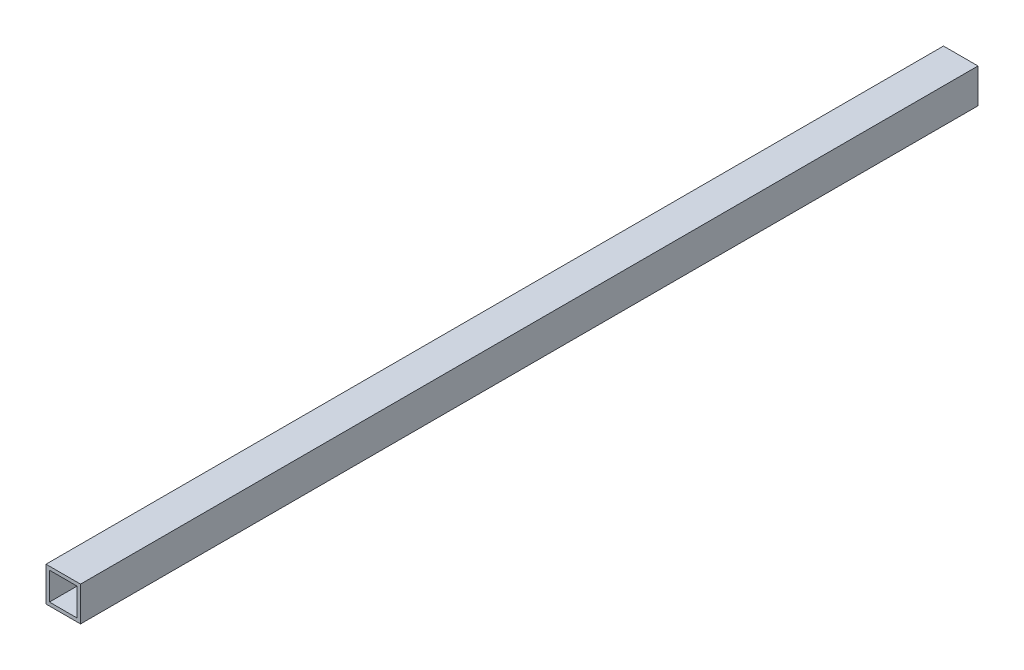
ISO-10303-21;
HEADER;
FILE_DESCRIPTION(('STEP AP214'),'2;1');
FILE_NAME('part.step','',(''),(''),'','','');
FILE_SCHEMA(('AUTOMOTIVE_DESIGN { 1 0 10303 214 1 1 1 1 }'));
ENDSEC;
DATA;
#1=APPLICATION_CONTEXT('core data for automotive mechanical design processes');
#2=APPLICATION_PROTOCOL_DEFINITION('international standard','automotive_design',2000,#1);
#3=PRODUCT_CONTEXT('',#1,'mechanical');
#4=PRODUCT('Part','Part','',(#3));
#5=PRODUCT_RELATED_PRODUCT_CATEGORY('part','',(#4));
#6=PRODUCT_DEFINITION_FORMATION('','',#4);
#7=PRODUCT_DEFINITION_CONTEXT('part definition',#1,'design');
#8=PRODUCT_DEFINITION('design','',#6,#7);
#9=PRODUCT_DEFINITION_SHAPE('','',#8);
#10=(LENGTH_UNIT() NAMED_UNIT(*) SI_UNIT(.MILLI.,.METRE.));
#11=(NAMED_UNIT(*) PLANE_ANGLE_UNIT() SI_UNIT($,.RADIAN.));
#12=(NAMED_UNIT(*) SI_UNIT($,.STERADIAN.) SOLID_ANGLE_UNIT());
#13=UNCERTAINTY_MEASURE_WITH_UNIT(LENGTH_MEASURE(1.E-05),#10,'distance_accuracy_value','');
#14=(GEOMETRIC_REPRESENTATION_CONTEXT(3) GLOBAL_UNCERTAINTY_ASSIGNED_CONTEXT((#13)) GLOBAL_UNIT_ASSIGNED_CONTEXT((#10,
#11,#12)) REPRESENTATION_CONTEXT('',''));
#15=CARTESIAN_POINT('',(0.,0.,0.));
#16=DIRECTION('',(0.,0.,1.));
#17=DIRECTION('',(1.,0.,0.));
#18=AXIS2_PLACEMENT_3D('',#15,#16,#17);
#19=CARTESIAN_POINT('',(9.99999999999999,10.,500.));
#20=DIRECTION('',(-1.,0.,0.));
#21=DIRECTION('',(0.,0.,1.));
#22=AXIS2_PLACEMENT_3D('',#19,#20,#21);
#23=PLANE('',#22);
#24=DIRECTION('',(0.,1.,0.));
#25=VECTOR('',#24,1.);
#26=CARTESIAN_POINT('',(9.99999999999999,10.,0.));
#27=LINE('',#26,#25);
#28=CARTESIAN_POINT('',(9.99999999999999,-10.,0.));
#29=VERTEX_POINT('',#28);
#30=CARTESIAN_POINT('',(9.99999999999999,10.,0.));
#31=VERTEX_POINT('',#30);
#32=EDGE_CURVE('E144',#29,#31,#27,.T.);
#33=ORIENTED_EDGE('',*,*,#32,.T.);
#34=DIRECTION('',(0.,0.,-1.));
#35=VECTOR('',#34,1.);
#36=CARTESIAN_POINT('',(9.99999999999999,10.,500.));
#37=LINE('',#36,#35);
#38=CARTESIAN_POINT('',(9.99999999999999,10.,520.));
#39=VERTEX_POINT('',#38);
#40=EDGE_CURVE('E161',#39,#31,#37,.T.);
#41=ORIENTED_EDGE('',*,*,#40,.F.);
#42=DIRECTION('',(0.,1.,0.));
#43=VECTOR('',#42,1.);
#44=CARTESIAN_POINT('',(9.99999999999999,10.,520.));
#45=LINE('',#44,#43);
#46=CARTESIAN_POINT('',(9.99999999999999,-10.,520.));
#47=VERTEX_POINT('',#46);
#48=EDGE_CURVE('E130',#47,#39,#45,.T.);
#49=ORIENTED_EDGE('',*,*,#48,.F.);
#50=DIRECTION('',(0.,0.,-1.));
#51=VECTOR('',#50,1.);
#52=CARTESIAN_POINT('',(9.99999999999999,-10.,500.));
#53=LINE('',#52,#51);
#54=EDGE_CURVE('E154',#47,#29,#53,.T.);
#55=ORIENTED_EDGE('',*,*,#54,.T.);
#56=EDGE_LOOP('',(#33,#41,#49,#55));
#57=FACE_BOUND('',#56,.T.);
#58=ADVANCED_FACE('F35',(#57),#23,.F.);
#59=CARTESIAN_POINT('',(-10.,10.,500.));
#60=DIRECTION('',(0.,-1.,0.));
#61=DIRECTION('',(0.,0.,-1.));
#62=AXIS2_PLACEMENT_3D('',#59,#60,#61);
#63=PLANE('',#62);
#64=DIRECTION('',(-1.,0.,0.));
#65=VECTOR('',#64,1.);
#66=CARTESIAN_POINT('',(-10.,10.,0.));
#67=LINE('',#66,#65);
#68=CARTESIAN_POINT('',(-10.,10.,0.));
#69=VERTEX_POINT('',#68);
#70=EDGE_CURVE('E149',#31,#69,#67,.T.);
#71=ORIENTED_EDGE('',*,*,#70,.T.);
#72=DIRECTION('',(0.,0.,-1.));
#73=VECTOR('',#72,1.);
#74=CARTESIAN_POINT('',(-10.,10.,500.));
#75=LINE('',#74,#73);
#76=CARTESIAN_POINT('',(-10.,10.,520.));
#77=VERTEX_POINT('',#76);
#78=EDGE_CURVE('E158',#77,#69,#75,.T.);
#79=ORIENTED_EDGE('',*,*,#78,.F.);
#80=DIRECTION('',(-1.,0.,0.));
#81=VECTOR('',#80,1.);
#82=CARTESIAN_POINT('',(-10.,10.,520.));
#83=LINE('',#82,#81);
#84=EDGE_CURVE('E133',#39,#77,#83,.T.);
#85=ORIENTED_EDGE('',*,*,#84,.F.);
#86=ORIENTED_EDGE('',*,*,#40,.T.);
#87=EDGE_LOOP('',(#71,#79,#85,#86));
#88=FACE_BOUND('',#87,.T.);
#89=ADVANCED_FACE('F187',(#88),#63,.F.);
#90=CARTESIAN_POINT('',(-10.,10.,500.));
#91=DIRECTION('',(1.,0.,0.));
#92=DIRECTION('',(0.,1.,0.));
#93=AXIS2_PLACEMENT_3D('',#90,#91,#92);
#94=PLANE('',#93);
#95=CARTESIAN_POINT('',(-10.,0.,20.));
#96=DIRECTION('',(-1.,0.,0.));
#97=DIRECTION('',(0.,0.,1.));
#98=AXIS2_PLACEMENT_3D('',#95,#96,#97);
#99=CIRCLE('',#98,1.64999999999999);
#100=CARTESIAN_POINT('',(-10.,0.,21.65));
#101=VERTEX_POINT('',#100);
#102=EDGE_CURVE('E176',#101,#101,#99,.T.);
#103=ORIENTED_EDGE('',*,*,#102,.F.);
#104=EDGE_LOOP('',(#103));
#105=FACE_BOUND('',#104,.T.);
#106=CARTESIAN_POINT('',(-10.,0.,500.));
#107=DIRECTION('',(1.,0.,0.));
#108=DIRECTION('',(0.,1.,0.));
#109=AXIS2_PLACEMENT_3D('',#106,#107,#108);
#110=CIRCLE('',#109,1.64999999999999);
#111=CARTESIAN_POINT('',(-10.,1.64999999999999,500.));
#112=VERTEX_POINT('',#111);
#113=EDGE_CURVE('E119',#112,#112,#110,.T.);
#114=ORIENTED_EDGE('',*,*,#113,.T.);
#115=EDGE_LOOP('',(#114));
#116=FACE_BOUND('',#115,.T.);
#117=DIRECTION('',(0.,-1.,0.));
#118=VECTOR('',#117,1.);
#119=CARTESIAN_POINT('',(-10.,10.,0.));
#120=LINE('',#119,#118);
#121=CARTESIAN_POINT('',(-10.,-10.,0.));
#122=VERTEX_POINT('',#121);
#123=EDGE_CURVE('E151',#69,#122,#120,.T.);
#124=ORIENTED_EDGE('',*,*,#123,.T.);
#125=DIRECTION('',(0.,0.,-1.));
#126=VECTOR('',#125,1.);
#127=CARTESIAN_POINT('',(-10.,-10.,500.));
#128=LINE('',#127,#126);
#129=CARTESIAN_POINT('',(-10.,-10.,520.));
#130=VERTEX_POINT('',#129);
#131=EDGE_CURVE('E156',#130,#122,#128,.T.);
#132=ORIENTED_EDGE('',*,*,#131,.F.);
#133=DIRECTION('',(0.,-1.,0.));
#134=VECTOR('',#133,1.);
#135=CARTESIAN_POINT('',(-10.,10.,520.));
#136=LINE('',#135,#134);
#137=EDGE_CURVE('E136',#77,#130,#136,.T.);
#138=ORIENTED_EDGE('',*,*,#137,.F.);
#139=ORIENTED_EDGE('',*,*,#78,.T.);
#140=EDGE_LOOP('',(#124,#132,#138,#139));
#141=FACE_BOUND('',#140,.T.);
#142=ADVANCED_FACE('F184',(#105,#116,#141),#94,.F.);
#143=CARTESIAN_POINT('',(-10.,-10.,500.));
#144=DIRECTION('',(0.,1.,0.));
#145=DIRECTION('',(0.,0.,1.));
#146=AXIS2_PLACEMENT_3D('',#143,#144,#145);
#147=PLANE('',#146);
#148=DIRECTION('',(1.,0.,0.));
#149=VECTOR('',#148,1.);
#150=CARTESIAN_POINT('',(-10.,-10.,0.));
#151=LINE('',#150,#149);
#152=EDGE_CURVE('E59',#122,#29,#151,.T.);
#153=ORIENTED_EDGE('',*,*,#152,.T.);
#154=ORIENTED_EDGE('',*,*,#54,.F.);
#155=DIRECTION('',(1.,0.,0.));
#156=VECTOR('',#155,1.);
#157=CARTESIAN_POINT('',(-10.,-10.,520.));
#158=LINE('',#157,#156);
#159=EDGE_CURVE('E139',#130,#47,#158,.T.);
#160=ORIENTED_EDGE('',*,*,#159,.F.);
#161=ORIENTED_EDGE('',*,*,#131,.T.);
#162=EDGE_LOOP('',(#153,#154,#160,#161));
#163=FACE_BOUND('',#162,.T.);
#164=ADVANCED_FACE('F186',(#163),#147,.F.);
#165=CARTESIAN_POINT('',(0.,0.,0.));
#166=DIRECTION('',(0.,0.,1.));
#167=DIRECTION('',(1.,0.,0.));
#168=AXIS2_PLACEMENT_3D('',#165,#166,#167);
#169=PLANE('',#168);
#170=DIRECTION('',(0.,-1.,0.));
#171=VECTOR('',#170,1.);
#172=CARTESIAN_POINT('',(-8.,0.,0.));
#173=LINE('',#172,#171);
#174=CARTESIAN_POINT('',(-8.,8.,0.));
#175=VERTEX_POINT('',#174);
#176=CARTESIAN_POINT('',(-8.,-8.,0.));
#177=VERTEX_POINT('',#176);
#178=EDGE_CURVE('E43',#175,#177,#173,.T.);
#179=ORIENTED_EDGE('',*,*,#178,.T.);
#180=DIRECTION('',(1.,0.,0.));
#181=VECTOR('',#180,1.);
#182=CARTESIAN_POINT('',(0.,-8.,0.));
#183=LINE('',#182,#181);
#184=CARTESIAN_POINT('',(8.,-8.,0.));
#185=VERTEX_POINT('',#184);
#186=EDGE_CURVE('E11',#177,#185,#183,.T.);
#187=ORIENTED_EDGE('',*,*,#186,.T.);
#188=DIRECTION('',(0.,-1.,0.));
#189=VECTOR('',#188,1.);
#190=CARTESIAN_POINT('',(8.,0.,0.));
#191=LINE('',#190,#189);
#192=CARTESIAN_POINT('',(8.,8.,0.));
#193=VERTEX_POINT('',#192);
#194=EDGE_CURVE('E164',#193,#185,#191,.T.);
#195=ORIENTED_EDGE('',*,*,#194,.F.);
#196=DIRECTION('',(1.,0.,0.));
#197=VECTOR('',#196,1.);
#198=CARTESIAN_POINT('',(0.,8.,0.));
#199=LINE('',#198,#197);
#200=EDGE_CURVE('E107',#175,#193,#199,.T.);
#201=ORIENTED_EDGE('',*,*,#200,.F.);
#202=EDGE_LOOP('',(#179,#187,#195,#201));
#203=FACE_BOUND('',#202,.T.);
#204=ORIENTED_EDGE('',*,*,#32,.F.);
#205=ORIENTED_EDGE('',*,*,#152,.F.);
#206=ORIENTED_EDGE('',*,*,#123,.F.);
#207=ORIENTED_EDGE('',*,*,#70,.F.);
#208=EDGE_LOOP('',(#204,#205,#206,#207));
#209=FACE_BOUND('',#208,.T.);
#210=ADVANCED_FACE('F195',(#203,#209),#169,.F.);
#211=CARTESIAN_POINT('',(-8.,-8.,-60.0000000000001));
#212=DIRECTION('',(0.,-1.,0.));
#213=DIRECTION('',(0.,0.,-1.));
#214=AXIS2_PLACEMENT_3D('',#211,#212,#213);
#215=PLANE('',#214);
#216=DIRECTION('',(0.,0.,1.));
#217=VECTOR('',#216,1.);
#218=CARTESIAN_POINT('',(-8.,-8.,-60.0000000000001));
#219=LINE('',#218,#217);
#220=CARTESIAN_POINT('',(-8.,-8.,520.));
#221=VERTEX_POINT('',#220);
#222=EDGE_CURVE('E142',#177,#221,#219,.T.);
#223=ORIENTED_EDGE('',*,*,#222,.T.);
#224=DIRECTION('',(1.,0.,0.));
#225=VECTOR('',#224,1.);
#226=CARTESIAN_POINT('',(-8.,-8.,520.));
#227=LINE('',#226,#225);
#228=CARTESIAN_POINT('',(8.,-8.,520.));
#229=VERTEX_POINT('',#228);
#230=EDGE_CURVE('E125',#221,#229,#227,.T.);
#231=ORIENTED_EDGE('',*,*,#230,.T.);
#232=DIRECTION('',(0.,0.,1.));
#233=VECTOR('',#232,1.);
#234=CARTESIAN_POINT('',(8.,-8.,-60.0000000000001));
#235=LINE('',#234,#233);
#236=EDGE_CURVE('E110',#185,#229,#235,.T.);
#237=ORIENTED_EDGE('',*,*,#236,.F.);
#238=ORIENTED_EDGE('',*,*,#186,.F.);
#239=EDGE_LOOP('',(#223,#231,#237,#238));
#240=FACE_BOUND('',#239,.T.);
#241=ADVANCED_FACE('F210',(#240),#215,.F.);
#242=CARTESIAN_POINT('',(-8.,8.,-60.0000000000001));
#243=DIRECTION('',(-1.,0.,0.));
#244=DIRECTION('',(0.,0.,1.));
#245=AXIS2_PLACEMENT_3D('',#242,#243,#244);
#246=PLANE('',#245);
#247=CARTESIAN_POINT('',(-8.,0.,20.));
#248=DIRECTION('',(-1.,0.,0.));
#249=DIRECTION('',(0.,0.,1.));
#250=AXIS2_PLACEMENT_3D('',#247,#248,#249);
#251=CIRCLE('',#250,1.64999999999999);
#252=CARTESIAN_POINT('',(-8.,0.,21.65));
#253=VERTEX_POINT('',#252);
#254=EDGE_CURVE('E38',#253,#253,#251,.T.);
#255=ORIENTED_EDGE('',*,*,#254,.T.);
#256=EDGE_LOOP('',(#255));
#257=FACE_BOUND('',#256,.T.);
#258=CARTESIAN_POINT('',(-8.,0.,500.));
#259=DIRECTION('',(1.,0.,0.));
#260=DIRECTION('',(0.,0.,-1.));
#261=AXIS2_PLACEMENT_3D('',#258,#259,#260);
#262=CIRCLE('',#261,1.64999999999999);
#263=CARTESIAN_POINT('',(-8.,0.,498.35));
#264=VERTEX_POINT('',#263);
#265=EDGE_CURVE('E169',#264,#264,#262,.T.);
#266=ORIENTED_EDGE('',*,*,#265,.F.);
#267=EDGE_LOOP('',(#266));
#268=FACE_BOUND('',#267,.T.);
#269=DIRECTION('',(0.,0.,1.));
#270=VECTOR('',#269,1.);
#271=CARTESIAN_POINT('',(-8.,8.,-60.0000000000001));
#272=LINE('',#271,#270);
#273=CARTESIAN_POINT('',(-8.,8.,520.));
#274=VERTEX_POINT('',#273);
#275=EDGE_CURVE('E109',#175,#274,#272,.T.);
#276=ORIENTED_EDGE('',*,*,#275,.T.);
#277=DIRECTION('',(0.,-1.,0.));
#278=VECTOR('',#277,1.);
#279=CARTESIAN_POINT('',(-8.,8.,520.));
#280=LINE('',#279,#278);
#281=EDGE_CURVE('E123',#274,#221,#280,.T.);
#282=ORIENTED_EDGE('',*,*,#281,.T.);
#283=ORIENTED_EDGE('',*,*,#222,.F.);
#284=ORIENTED_EDGE('',*,*,#178,.F.);
#285=EDGE_LOOP('',(#276,#282,#283,#284));
#286=FACE_BOUND('',#285,.T.);
#287=ADVANCED_FACE('F214',(#257,#268,#286),#246,.F.);
#288=CARTESIAN_POINT('',(-8.,8.,-60.0000000000001));
#289=DIRECTION('',(0.,-1.,0.));
#290=DIRECTION('',(0.,0.,-1.));
#291=AXIS2_PLACEMENT_3D('',#288,#289,#290);
#292=PLANE('',#291);
#293=ORIENTED_EDGE('',*,*,#200,.T.);
#294=DIRECTION('',(0.,0.,1.));
#295=VECTOR('',#294,1.);
#296=CARTESIAN_POINT('',(8.,8.,-60.0000000000001));
#297=LINE('',#296,#295);
#298=CARTESIAN_POINT('',(8.,8.,520.));
#299=VERTEX_POINT('',#298);
#300=EDGE_CURVE('E51',#193,#299,#297,.T.);
#301=ORIENTED_EDGE('',*,*,#300,.T.);
#302=DIRECTION('',(-1.,0.,0.));
#303=VECTOR('',#302,1.);
#304=CARTESIAN_POINT('',(-8.,8.,520.));
#305=LINE('',#304,#303);
#306=EDGE_CURVE('E104',#299,#274,#305,.T.);
#307=ORIENTED_EDGE('',*,*,#306,.T.);
#308=ORIENTED_EDGE('',*,*,#275,.F.);
#309=EDGE_LOOP('',(#293,#301,#307,#308));
#310=FACE_BOUND('',#309,.T.);
#311=ADVANCED_FACE('F101',(#310),#292,.T.);
#312=CARTESIAN_POINT('',(8.,8.,-60.0000000000001));
#313=DIRECTION('',(-1.,0.,0.));
#314=DIRECTION('',(0.,-1.,0.));
#315=AXIS2_PLACEMENT_3D('',#312,#313,#314);
#316=PLANE('',#315);
#317=ORIENTED_EDGE('',*,*,#194,.T.);
#318=ORIENTED_EDGE('',*,*,#236,.T.);
#319=DIRECTION('',(0.,1.,0.));
#320=VECTOR('',#319,1.);
#321=CARTESIAN_POINT('',(8.,8.,520.));
#322=LINE('',#321,#320);
#323=EDGE_CURVE('E113',#229,#299,#322,.T.);
#324=ORIENTED_EDGE('',*,*,#323,.T.);
#325=ORIENTED_EDGE('',*,*,#300,.F.);
#326=EDGE_LOOP('',(#317,#318,#324,#325));
#327=FACE_BOUND('',#326,.T.);
#328=ADVANCED_FACE('F114',(#327),#316,.T.);
#329=CARTESIAN_POINT('',(0.,0.,520.));
#330=DIRECTION('',(0.,0.,1.));
#331=DIRECTION('',(1.,0.,0.));
#332=AXIS2_PLACEMENT_3D('',#329,#330,#331);
#333=PLANE('',#332);
#334=ORIENTED_EDGE('',*,*,#48,.T.);
#335=ORIENTED_EDGE('',*,*,#84,.T.);
#336=ORIENTED_EDGE('',*,*,#137,.T.);
#337=ORIENTED_EDGE('',*,*,#159,.T.);
#338=EDGE_LOOP('',(#334,#335,#336,#337));
#339=FACE_BOUND('',#338,.T.);
#340=ORIENTED_EDGE('',*,*,#306,.F.);
#341=ORIENTED_EDGE('',*,*,#323,.F.);
#342=ORIENTED_EDGE('',*,*,#230,.F.);
#343=ORIENTED_EDGE('',*,*,#281,.F.);
#344=EDGE_LOOP('',(#340,#341,#342,#343));
#345=FACE_BOUND('',#344,.T.);
#346=ADVANCED_FACE('F121',(#339,#345),#333,.T.);
#347=CARTESIAN_POINT('',(-8.,0.,500.));
#348=DIRECTION('',(1.,0.,0.));
#349=DIRECTION('',(0.,0.,-1.));
#350=AXIS2_PLACEMENT_3D('',#347,#348,#349);
#351=CYLINDRICAL_SURFACE('',#350,1.64999999999999);
#352=ORIENTED_EDGE('',*,*,#265,.T.);
#353=EDGE_LOOP('',(#352));
#354=FACE_BOUND('',#353,.T.);
#355=ORIENTED_EDGE('',*,*,#113,.F.);
#356=EDGE_LOOP('',(#355));
#357=FACE_BOUND('',#356,.T.);
#358=ADVANCED_FACE('F225',(#354,#357),#351,.F.);
#359=CARTESIAN_POINT('',(-10.,0.,20.));
#360=DIRECTION('',(-1.,0.,0.));
#361=DIRECTION('',(0.,0.,1.));
#362=AXIS2_PLACEMENT_3D('',#359,#360,#361);
#363=CYLINDRICAL_SURFACE('',#362,1.64999999999999);
#364=ORIENTED_EDGE('',*,*,#102,.T.);
#365=EDGE_LOOP('',(#364));
#366=FACE_BOUND('',#365,.T.);
#367=ORIENTED_EDGE('',*,*,#254,.F.);
#368=EDGE_LOOP('',(#367));
#369=FACE_BOUND('',#368,.T.);
#370=ADVANCED_FACE('F181',(#366,#369),#363,.F.);
#371=CLOSED_SHELL('',(#58,#89,#142,#164,#210,#241,#287,#311,#328,#346,#358,#370));
#372=MANIFOLD_SOLID_BREP('B2',#371);
#373=ADVANCED_BREP_SHAPE_REPRESENTATION('',(#18,#372),#14);
#374=SHAPE_DEFINITION_REPRESENTATION(#9,#373);
ENDSEC;
END-ISO-10303-21;
